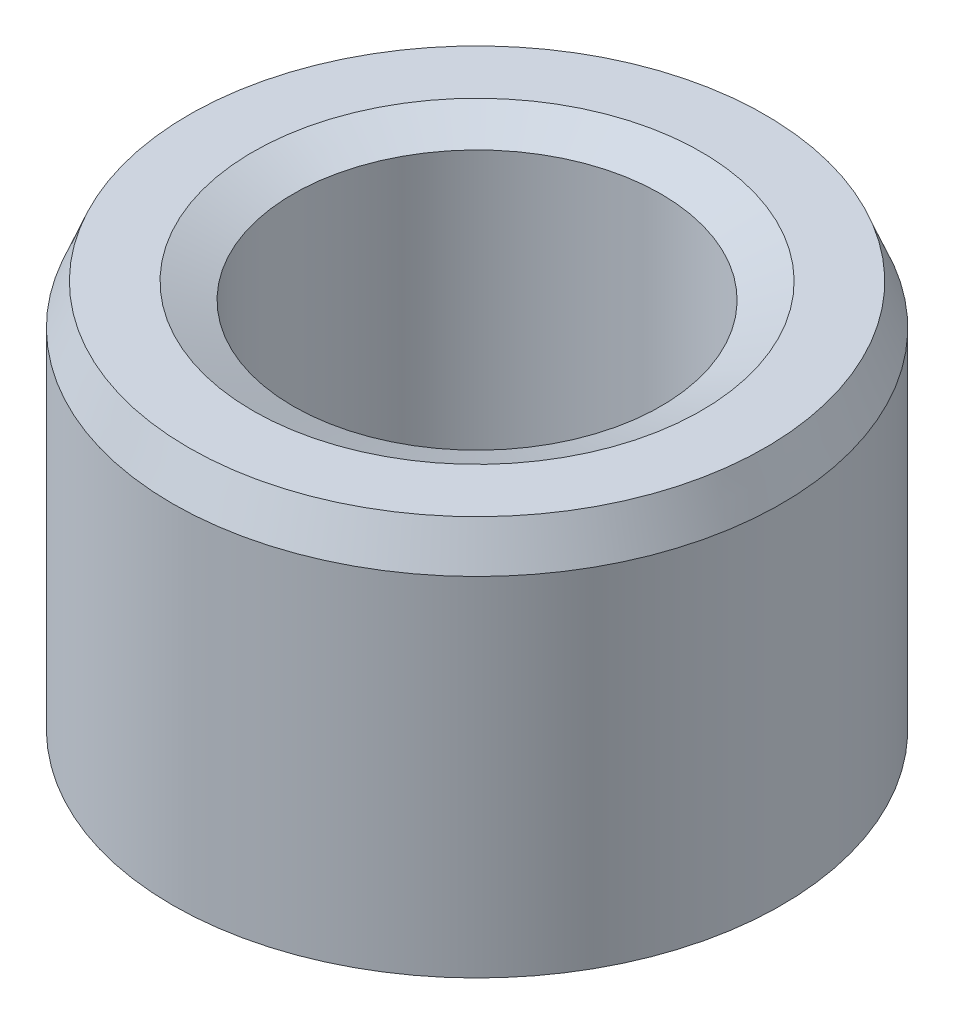
ISO-10303-21;
HEADER;
FILE_DESCRIPTION(('STEP AP214'),'2;1');
FILE_NAME('part.step','',(''),(''),'','','');
FILE_SCHEMA(('AUTOMOTIVE_DESIGN { 1 0 10303 214 1 1 1 1 }'));
ENDSEC;
DATA;
#1=APPLICATION_CONTEXT('core data for automotive mechanical design processes');
#2=APPLICATION_PROTOCOL_DEFINITION('international standard','automotive_design',2000,#1);
#3=PRODUCT_CONTEXT('',#1,'mechanical');
#4=PRODUCT('Part','Part','',(#3));
#5=PRODUCT_RELATED_PRODUCT_CATEGORY('part','',(#4));
#6=PRODUCT_DEFINITION_FORMATION('','',#4);
#7=PRODUCT_DEFINITION_CONTEXT('part definition',#1,'design');
#8=PRODUCT_DEFINITION('design','',#6,#7);
#9=PRODUCT_DEFINITION_SHAPE('','',#8);
#10=(LENGTH_UNIT() NAMED_UNIT(*) SI_UNIT(.MILLI.,.METRE.));
#11=(NAMED_UNIT(*) PLANE_ANGLE_UNIT() SI_UNIT($,.RADIAN.));
#12=(NAMED_UNIT(*) SI_UNIT($,.STERADIAN.) SOLID_ANGLE_UNIT());
#13=UNCERTAINTY_MEASURE_WITH_UNIT(LENGTH_MEASURE(1.E-05),#10,'distance_accuracy_value','');
#14=(GEOMETRIC_REPRESENTATION_CONTEXT(3) GLOBAL_UNCERTAINTY_ASSIGNED_CONTEXT((#13)) GLOBAL_UNIT_ASSIGNED_CONTEXT((#10,
#11,#12)) REPRESENTATION_CONTEXT('',''));
#15=CARTESIAN_POINT('',(0.,0.,0.));
#16=DIRECTION('',(0.,0.,1.));
#17=DIRECTION('',(1.,0.,0.));
#18=AXIS2_PLACEMENT_3D('',#15,#16,#17);
#19=CARTESIAN_POINT('',(0.,26.548351911749,0.));
#20=DIRECTION('',(0.,-1.,0.));
#21=DIRECTION('',(0.,0.,-1.));
#22=AXIS2_PLACEMENT_3D('',#19,#20,#21);
#23=CYLINDRICAL_SURFACE('',#22,20.);
#24=CARTESIAN_POINT('',(0.,1.0674622545707,0.));
#25=DIRECTION('',(0.,1.,0.));
#26=DIRECTION('',(0.,0.,1.));
#27=AXIS2_PLACEMENT_3D('',#24,#25,#26);
#28=CIRCLE('',#27,20.);
#29=CARTESIAN_POINT('',(0.,1.0674622545707,20.));
#30=VERTEX_POINT('',#29);
#31=EDGE_CURVE('E10',#30,#30,#28,.T.);
#32=ORIENTED_EDGE('',*,*,#31,.T.);
#33=EDGE_LOOP('',(#32));
#34=FACE_BOUND('',#33,.T.);
#35=CARTESIAN_POINT('',(0.,23.9010446228975,0.));
#36=DIRECTION('',(0.,1.,0.));
#37=DIRECTION('',(0.,0.,1.));
#38=AXIS2_PLACEMENT_3D('',#35,#36,#37);
#39=CIRCLE('',#38,20.);
#40=CARTESIAN_POINT('',(0.,23.9010446228975,20.));
#41=VERTEX_POINT('',#40);
#42=EDGE_CURVE('E50',#41,#41,#39,.F.);
#43=ORIENTED_EDGE('',*,*,#42,.T.);
#44=EDGE_LOOP('',(#43));
#45=FACE_BOUND('',#44,.T.);
#46=ADVANCED_FACE('F39',(#34,#45),#23,.T.);
#47=CARTESIAN_POINT('',(0.,26.548351911749,0.));
#48=DIRECTION('',(0.,1.,0.));
#49=DIRECTION('',(0.,0.,1.));
#50=AXIS2_PLACEMENT_3D('',#47,#48,#49);
#51=PLANE('',#50);
#52=CARTESIAN_POINT('',(0.,26.548351911749,0.));
#53=DIRECTION('',(0.,1.,0.));
#54=DIRECTION('',(0.,0.,1.));
#55=AXIS2_PLACEMENT_3D('',#52,#53,#54);
#56=CIRCLE('',#55,14.7238597450675);
#57=CARTESIAN_POINT('',(0.,26.548351911749,14.7238597450675));
#58=VERTEX_POINT('',#57);
#59=EDGE_CURVE('E58',#58,#58,#56,.F.);
#60=ORIENTED_EDGE('',*,*,#59,.T.);
#61=EDGE_LOOP('',(#60));
#62=FACE_BOUND('',#61,.T.);
#63=CARTESIAN_POINT('',(0.,26.548351911749,0.));
#64=DIRECTION('',(0.,1.,0.));
#65=DIRECTION('',(0.,0.,1.));
#66=AXIS2_PLACEMENT_3D('',#63,#64,#65);
#67=CIRCLE('',#66,18.9325377454293);
#68=CARTESIAN_POINT('',(0.,26.548351911749,18.9325377454293));
#69=VERTEX_POINT('',#68);
#70=EDGE_CURVE('E61',#69,#69,#67,.T.);
#71=ORIENTED_EDGE('',*,*,#70,.T.);
#72=EDGE_LOOP('',(#71));
#73=FACE_BOUND('',#72,.T.);
#74=ADVANCED_FACE('F88',(#62,#73),#51,.T.);
#75=CARTESIAN_POINT('',(0.,0.,0.));
#76=DIRECTION('',(0.,1.,0.));
#77=DIRECTION('',(0.,0.,1.));
#78=AXIS2_PLACEMENT_3D('',#75,#76,#77);
#79=PLANE('',#78);
#80=CARTESIAN_POINT('',(0.,0.,0.));
#81=DIRECTION('',(0.,1.,0.));
#82=DIRECTION('',(0.,0.,1.));
#83=AXIS2_PLACEMENT_3D('',#80,#81,#82);
#84=CIRCLE('',#83,13.1440147107868);
#85=CARTESIAN_POINT('',(0.,0.,-13.1440147107868));
#86=VERTEX_POINT('',#85);
#87=EDGE_CURVE('E51',#86,#86,#84,.T.);
#88=ORIENTED_EDGE('',*,*,#87,.T.);
#89=EDGE_LOOP('',(#88));
#90=FACE_BOUND('',#89,.T.);
#91=CARTESIAN_POINT('',(0.,0.,0.));
#92=DIRECTION('',(0.,1.,0.));
#93=DIRECTION('',(0.,0.,1.));
#94=AXIS2_PLACEMENT_3D('',#91,#92,#93);
#95=CIRCLE('',#94,17.3526927111486);
#96=CARTESIAN_POINT('',(0.,0.,17.3526927111486));
#97=VERTEX_POINT('',#96);
#98=EDGE_CURVE('E54',#97,#97,#95,.F.);
#99=ORIENTED_EDGE('',*,*,#98,.T.);
#100=EDGE_LOOP('',(#99));
#101=FACE_BOUND('',#100,.T.);
#102=ADVANCED_FACE('F83',(#90,#101),#79,.F.);
#103=CARTESIAN_POINT('',(0.,26.548351911749,0.));
#104=DIRECTION('',(0.,-1.,0.));
#105=DIRECTION('',(0.,0.,-1.));
#106=AXIS2_PLACEMENT_3D('',#103,#104,#105);
#107=CYLINDRICAL_SURFACE('',#106,12.0765524562161);
#108=CARTESIAN_POINT('',(0.,25.4808896571783,0.));
#109=DIRECTION('',(0.,1.,0.));
#110=DIRECTION('',(0.,0.,1.));
#111=AXIS2_PLACEMENT_3D('',#108,#109,#110);
#112=CIRCLE('',#111,12.0765524562161);
#113=CARTESIAN_POINT('',(0.,25.4808896571783,-12.0765524562161));
#114=VERTEX_POINT('',#113);
#115=EDGE_CURVE('E67',#114,#114,#112,.T.);
#116=CARTESIAN_POINT('',(0.,2.64730728885141,0.));
#117=DIRECTION('',(0.,1.,0.));
#118=DIRECTION('',(0.,0.,1.));
#119=AXIS2_PLACEMENT_3D('',#116,#117,#118);
#120=CIRCLE('',#119,12.0765524562161);
#121=CARTESIAN_POINT('',(0.,2.64730728885141,-12.0765524562161));
#122=VERTEX_POINT('',#121);
#123=EDGE_CURVE('E69',#122,#122,#120,.F.);
#124=CARTESIAN_POINT('',(0.,25.4808896571783,-12.0765524562161));
#125=CARTESIAN_POINT('',(0.,25.2430398408416,-12.0765524562161));
#126=CARTESIAN_POINT('',(0.,25.0051900245048,-12.0765524562161));
#127=CARTESIAN_POINT('',(0.,24.5294903918313,-12.0765524562161));
#128=CARTESIAN_POINT('',(0.,24.2916405754946,-12.0765524562161));
#129=CARTESIAN_POINT('',(0.,23.8159409428211,-12.0765524562161));
#130=CARTESIAN_POINT('',(0.,23.5780911264844,-12.0765524562161));
#131=CARTESIAN_POINT('',(0.,23.1023914938109,-12.0765524562161));
#132=CARTESIAN_POINT('',(0.,22.8645416774742,-12.0765524562161));
#133=CARTESIAN_POINT('',(0.,22.3888420448007,-12.0765524562161));
#134=CARTESIAN_POINT('',(0.,22.150992228464,-12.0765524562161));
#135=CARTESIAN_POINT('',(0.,21.6752925957905,-12.0765524562161));
#136=CARTESIAN_POINT('',(0.,21.4374427794537,-12.0765524562161));
#137=CARTESIAN_POINT('',(0.,20.9617431467803,-12.0765524562161));
#138=CARTESIAN_POINT('',(0.,20.7238933304435,-12.0765524562161));
#139=CARTESIAN_POINT('',(0.,20.2481936977701,-12.0765524562161));
#140=CARTESIAN_POINT('',(0.,20.0103438814333,-12.0765524562161));
#141=CARTESIAN_POINT('',(0.,19.5346442487598,-12.0765524562161));
#142=CARTESIAN_POINT('',(0.,19.2967944324231,-12.0765524562161));
#143=CARTESIAN_POINT('',(0.,18.8210947997496,-12.0765524562161));
#144=CARTESIAN_POINT('',(0.,18.5832449834129,-12.0765524562161));
#145=CARTESIAN_POINT('',(0.,18.1075453507394,-12.0765524562161));
#146=CARTESIAN_POINT('',(0.,17.8696955344027,-12.0765524562161));
#147=CARTESIAN_POINT('',(0.,17.3939959017292,-12.0765524562161));
#148=CARTESIAN_POINT('',(0.,17.1561460853925,-12.0765524562161));
#149=CARTESIAN_POINT('',(0.,16.680446452719,-12.0765524562161));
#150=CARTESIAN_POINT('',(0.,16.4425966363822,-12.0765524562161));
#151=CARTESIAN_POINT('',(0.,15.9668970037088,-12.0765524562161));
#152=CARTESIAN_POINT('',(0.,15.729047187372,-12.0765524562161));
#153=CARTESIAN_POINT('',(0.,15.2533475546985,-12.0765524562161));
#154=CARTESIAN_POINT('',(0.,15.0154977383618,-12.0765524562161));
#155=CARTESIAN_POINT('',(0.,14.5397981056883,-12.0765524562161));
#156=CARTESIAN_POINT('',(0.,14.3019482893516,-12.0765524562161));
#157=CARTESIAN_POINT('',(0.,13.8262486566781,-12.0765524562161));
#158=CARTESIAN_POINT('',(0.,13.5883988403414,-12.0765524562161));
#159=CARTESIAN_POINT('',(0.,13.1126992076679,-12.0765524562161));
#160=CARTESIAN_POINT('',(0.,12.8748493913312,-12.0765524562161));
#161=CARTESIAN_POINT('',(0.,12.3991497586577,-12.0765524562161));
#162=CARTESIAN_POINT('',(0.,12.1612999423209,-12.0765524562161));
#163=CARTESIAN_POINT('',(0.,11.6856003096475,-12.0765524562161));
#164=CARTESIAN_POINT('',(0.,11.4477504933107,-12.0765524562161));
#165=CARTESIAN_POINT('',(0.,10.9720508606373,-12.0765524562161));
#166=CARTESIAN_POINT('',(0.,10.7342010443005,-12.0765524562161));
#167=CARTESIAN_POINT('',(0.,10.258501411627,-12.0765524562161));
#168=CARTESIAN_POINT('',(0.,10.0206515952903,-12.0765524562161));
#169=CARTESIAN_POINT('',(0.,9.54495196261682,-12.0765524562161));
#170=CARTESIAN_POINT('',(0.,9.30710214628008,-12.0765524562161));
#171=CARTESIAN_POINT('',(0.,8.8314025136066,-12.0765524562161));
#172=CARTESIAN_POINT('',(0.,8.59355269726987,-12.0765524562161));
#173=CARTESIAN_POINT('',(0.,8.11785306459639,-12.0765524562161));
#174=CARTESIAN_POINT('',(0.,7.88000324825965,-12.0765524562161));
#175=CARTESIAN_POINT('',(0.,7.40430361558618,-12.0765524562161));
#176=CARTESIAN_POINT('',(0.,7.16645379924944,-12.0765524562161));
#177=CARTESIAN_POINT('',(0.,6.69075416657596,-12.0765524562161));
#178=CARTESIAN_POINT('',(0.,6.45290435023922,-12.0765524562161));
#179=CARTESIAN_POINT('',(0.,5.97720471756575,-12.0765524562161));
#180=CARTESIAN_POINT('',(0.,5.73935490122901,-12.0765524562161));
#181=CARTESIAN_POINT('',(0.,5.26365526855553,-12.0765524562161));
#182=CARTESIAN_POINT('',(0.,5.02580545221879,-12.0765524562161));
#183=CARTESIAN_POINT('',(0.,4.55010581954531,-12.0765524562161));
#184=CARTESIAN_POINT('',(0.,4.31225600320858,-12.0765524562161));
#185=CARTESIAN_POINT('',(0.,3.8365563705351,-12.0765524562161));
#186=CARTESIAN_POINT('',(0.,3.59870655419836,-12.0765524562161));
#187=CARTESIAN_POINT('',(0.,3.12300692152488,-12.0765524562161));
#188=CARTESIAN_POINT('',(0.,2.88515710518815,-12.0765524562161));
#189=CARTESIAN_POINT('',(0.,2.64730728885141,-12.0765524562161));
#190=B_SPLINE_CURVE_WITH_KNOTS('',3,(#124,#125,#126,#127,#128,#129,#130,#131,#132,#133,#134,
#135,#136,#137,#138,#139,#140,#141,#142,#143,#144,#145,#146,#147,#148,#149,#150,#151,#152,#153,
#154,#155,#156,#157,#158,#159,#160,#161,#162,#163,#164,#165,#166,#167,#168,#169,#170,#171,#172,
#173,#174,#175,#176,#177,#178,#179,#180,#181,#182,#183,#184,#185,#186,#187,#188,#189),
.UNSPECIFIED.,.F.,.F.,(4,2,2,2,2,2,2,2,2,2,2,2,2,2,2,2,2,2,2,2,2,2,2,2,2,2,2,2,2,2,2,2,4),(0.,
0.713549449010219,1.42709889802043,2.14064834703065,2.85419779604086,3.56774724505108,
4.28129669406129,4.99484614307151,5.70839559208172,6.42194504109194,7.13549449010215,
7.84904393911237,8.56259338812258,9.2761428371328,9.98969228614301,10.7032417351532,
11.4167911841634,12.1303406331737,12.8438900821839,13.5574395311941,14.2709889802043,
14.9845384292145,15.6980878782247,16.411637327235,17.1251867762452,17.8387362252554,
18.5522856742656,19.2658351232758,19.979384572286,20.6929340212962,21.4064834703065,
22.1200329193167,22.8335823683269),.UNSPECIFIED.);
#191=EDGE_CURVE('BSEAM71',#114,#122,#190,.T.);
#192=ORIENTED_EDGE('',*,*,#115,.T.);
#193=ORIENTED_EDGE('',*,*,#123,.T.);
#194=ORIENTED_EDGE('',*,*,#191,.T.);
#195=ORIENTED_EDGE('',*,*,#191,.F.);
#196=EDGE_LOOP('',(#192,#194,#193,#195));
#197=FACE_BOUND('',#196,.T.);
#198=ADVANCED_FACE('F71',(#197),#107,.F.);
#199=CARTESIAN_POINT('',(0.,25.4808896571783,0.));
#200=DIRECTION('',(0.,1.,0.));
#201=DIRECTION('',(0.,0.,1.));
#202=AXIS2_PLACEMENT_3D('',#199,#200,#201);
#203=CONICAL_SURFACE('',#202,12.0765524562161,1.1875122966362);
#204=ORIENTED_EDGE('',*,*,#59,.F.);
#205=EDGE_LOOP('',(#204));
#206=FACE_BOUND('',#205,.T.);
#207=ORIENTED_EDGE('',*,*,#115,.F.);
#208=EDGE_LOOP('',(#207));
#209=FACE_BOUND('',#208,.T.);
#210=ADVANCED_FACE('F77',(#206,#209),#203,.F.);
#211=CARTESIAN_POINT('',(0.,0.,0.));
#212=DIRECTION('',(0.,-1.,0.));
#213=DIRECTION('',(0.,0.,-1.));
#214=AXIS2_PLACEMENT_3D('',#211,#212,#213);
#215=CONICAL_SURFACE('',#214,13.1440147107868,0.383284030158699);
#216=CARTESIAN_POINT('',(0.,2.64730728885141,-12.0765524562161));
#217=CARTESIAN_POINT('',(0.,2.61973117125921,-12.0876718547012));
#218=CARTESIAN_POINT('',(0.,2.59215505366701,-12.0987912531863));
#219=CARTESIAN_POINT('',(0.,2.5370028184826,-12.1210300501565));
#220=CARTESIAN_POINT('',(0.,2.5094267008904,-12.1321494486417));
#221=CARTESIAN_POINT('',(0.,2.45427446570599,-12.1543882456119));
#222=CARTESIAN_POINT('',(0.,2.42669834811379,-12.165507644097));
#223=CARTESIAN_POINT('',(0.,2.37154611292939,-12.1877464410672));
#224=CARTESIAN_POINT('',(0.,2.34396999533719,-12.1988658395523));
#225=CARTESIAN_POINT('',(0.,2.28881776015278,-12.2211046365225));
#226=CARTESIAN_POINT('',(0.,2.26124164256058,-12.2322240350077));
#227=CARTESIAN_POINT('',(0.,2.20608940737617,-12.2544628319779));
#228=CARTESIAN_POINT('',(0.,2.17851328978397,-12.265582230463));
#229=CARTESIAN_POINT('',(0.,2.12336105459957,-12.2878210274332));
#230=CARTESIAN_POINT('',(0.,2.09578493700737,-12.2989404259183));
#231=CARTESIAN_POINT('',(0.,2.04063270182296,-12.3211792228885));
#232=CARTESIAN_POINT('',(0.,2.01305658423076,-12.3322986213737));
#233=CARTESIAN_POINT('',(0.,1.95790434904635,-12.3545374183439));
#234=CARTESIAN_POINT('',(0.,1.93032823145415,-12.365656816829));
#235=CARTESIAN_POINT('',(0.,1.87517599626975,-12.3878956137992));
#236=CARTESIAN_POINT('',(0.,1.84759987867755,-12.3990150122843));
#237=CARTESIAN_POINT('',(0.,1.79244764349314,-12.4212538092546));
#238=CARTESIAN_POINT('',(0.,1.76487152590094,-12.4323732077397));
#239=CARTESIAN_POINT('',(0.,1.70971929071654,-12.4546120047099));
#240=CARTESIAN_POINT('',(0.,1.68214317312433,-12.465731403195));
#241=CARTESIAN_POINT('',(0.,1.62699093793993,-12.4879702001652));
#242=CARTESIAN_POINT('',(0.,1.59941482034773,-12.4990895986503));
#243=CARTESIAN_POINT('',(0.,1.54426258516332,-12.5213283956206));
#244=CARTESIAN_POINT('',(0.,1.51668646757112,-12.5324477941057));
#245=CARTESIAN_POINT('',(0.,1.46153423238672,-12.5546865910759));
#246=CARTESIAN_POINT('',(0.,1.43395811479451,-12.565805989561));
#247=CARTESIAN_POINT('',(0.,1.37880587961011,-12.5880447865312));
#248=CARTESIAN_POINT('',(0.,1.35122976201791,-12.5991641850163));
#249=CARTESIAN_POINT('',(0.,1.2960775268335,-12.6214029819866));
#250=CARTESIAN_POINT('',(0.,1.2685014092413,-12.6325223804717));
#251=CARTESIAN_POINT('',(0.,1.2133491740569,-12.6547611774419));
#252=CARTESIAN_POINT('',(0.,1.18577305646469,-12.665880575927));
#253=CARTESIAN_POINT('',(0.,1.13062082128029,-12.6881193728972));
#254=CARTESIAN_POINT('',(0.,1.10304470368809,-12.6992387713823));
#255=CARTESIAN_POINT('',(0.,1.04789246850368,-12.7214775683526));
#256=CARTESIAN_POINT('',(0.,1.02031635091148,-12.7325969668377));
#257=CARTESIAN_POINT('',(0.,0.965164115727076,-12.7548357638079));
#258=CARTESIAN_POINT('',(0.,0.937587998134874,-12.765955162293));
#259=CARTESIAN_POINT('',(0.,0.88243576295047,-12.7881939592632));
#260=CARTESIAN_POINT('',(0.,0.854859645358268,-12.7993133577483));
#261=CARTESIAN_POINT('',(0.,0.799707410173863,-12.8215521547186));
#262=CARTESIAN_POINT('',(0.,0.772131292581661,-12.8326715532037));
#263=CARTESIAN_POINT('',(0.,0.716979057397257,-12.8549103501739));
#264=CARTESIAN_POINT('',(0.,0.689402939805054,-12.866029748659));
#265=CARTESIAN_POINT('',(0.,0.63425070462065,-12.8882685456292));
#266=CARTESIAN_POINT('',(0.,0.606674587028448,-12.8993879441143));
#267=CARTESIAN_POINT('',(0.,0.551522351844044,-12.9216267410846));
#268=CARTESIAN_POINT('',(0.,0.523946234251841,-12.9327461395697));
#269=CARTESIAN_POINT('',(0.,0.468793999067437,-12.9549849365399));
#270=CARTESIAN_POINT('',(0.,0.441217881475235,-12.966104335025));
#271=CARTESIAN_POINT('',(0.,0.38606564629083,-12.9883431319952));
#272=CARTESIAN_POINT('',(0.,0.358489528698628,-12.9994625304803));
#273=CARTESIAN_POINT('',(0.,0.303337293514224,-13.0217013274506));
#274=CARTESIAN_POINT('',(0.,0.275761175922022,-13.0328207259357));
#275=CARTESIAN_POINT('',(0.,0.220608940737618,-13.0550595229059));
#276=CARTESIAN_POINT('',(0.,0.193032823145415,-13.066178921391));
#277=CARTESIAN_POINT('',(0.,0.137880587961011,-13.0884177183612));
#278=CARTESIAN_POINT('',(0.,0.110304470368809,-13.0995371168463));
#279=CARTESIAN_POINT('',(0.,0.0551522351844044,-13.1217759138166));
#280=CARTESIAN_POINT('',(0.,0.0275761175922024,-13.1328953123017));
#281=CARTESIAN_POINT('',(0.,0.,-13.1440147107868));
#282=B_SPLINE_CURVE_WITH_KNOTS('',3,(#216,#217,#218,#219,#220,#221,#222,#223,#224,#225,#226,
#227,#228,#229,#230,#231,#232,#233,#234,#235,#236,#237,#238,#239,#240,#241,#242,#243,#244,#245,
#246,#247,#248,#249,#250,#251,#252,#253,#254,#255,#256,#257,#258,#259,#260,#261,#262,#263,#264,
#265,#266,#267,#268,#269,#270,#271,#272,#273,#274,#275,#276,#277,#278,#279,#280,#281),
.UNSPECIFIED.,.F.,.F.,(4,2,2,2,2,2,2,2,2,2,2,2,2,2,2,2,2,2,2,2,2,2,2,2,2,2,2,2,2,2,2,2,4),(0.,
0.0892006141075656,0.178401228215132,0.267601842322699,0.356802456430265,0.44600307053783,
0.535203684645397,0.624404298752963,0.713604912860529,0.802805526968095,0.892006141075661,
0.981206755183227,1.07040736929079,1.15960798339836,1.24880859750593,1.33800921161349,
1.42720982572106,1.51641043982862,1.60561105393619,1.69481166804376,1.78401228215132,
1.87321289625889,1.96241351036645,2.05161412447402,2.14081473858159,2.23001535268915,
2.31921596679672,2.40841658090429,2.49761719501185,2.58681780911942,2.67601842322698,
2.76521903733455,2.85441965144212),.UNSPECIFIED.);
#283=EDGE_CURVE('BSEAM73',#122,#86,#282,.T.);
#284=ORIENTED_EDGE('',*,*,#123,.F.);
#285=ORIENTED_EDGE('',*,*,#87,.F.);
#286=ORIENTED_EDGE('',*,*,#283,.T.);
#287=ORIENTED_EDGE('',*,*,#283,.F.);
#288=EDGE_LOOP('',(#284,#286,#285,#287));
#289=FACE_BOUND('',#288,.T.);
#290=ADVANCED_FACE('F73',(#289),#215,.F.);
#291=CARTESIAN_POINT('',(0.,1.0674622545707,0.));
#292=DIRECTION('',(0.,1.,0.));
#293=DIRECTION('',(0.,0.,1.));
#294=AXIS2_PLACEMENT_3D('',#291,#292,#293);
#295=CONICAL_SURFACE('',#294,20.,1.1875122966362);
#296=CARTESIAN_POINT('',(0.,0.,17.3526927111486));
#297=CARTESIAN_POINT('',(0.,0.0111193984851112,17.3802688287408));
#298=CARTESIAN_POINT('',(0.,0.0222387969702226,17.407844946333));
#299=CARTESIAN_POINT('',(0.,0.0444775939404455,17.4629971815174));
#300=CARTESIAN_POINT('',(0.,0.0555969924255569,17.4905732991096));
#301=CARTESIAN_POINT('',(0.,0.0778357893957797,17.545725534294));
#302=CARTESIAN_POINT('',(0.,0.088955187880891,17.5733016518862));
#303=CARTESIAN_POINT('',(0.,0.111193984851114,17.6284538870706));
#304=CARTESIAN_POINT('',(0.,0.122313383336225,17.6560300046628));
#305=CARTESIAN_POINT('',(0.,0.144552180306448,17.7111822398472));
#306=CARTESIAN_POINT('',(0.,0.15567157879156,17.7387583574394));
#307=CARTESIAN_POINT('',(0.,0.177910375761782,17.7939105926238));
#308=CARTESIAN_POINT('',(0.,0.189029774246894,17.821486710216));
#309=CARTESIAN_POINT('',(0.,0.211268571217117,17.8766389454004));
#310=CARTESIAN_POINT('',(0.,0.222387969702228,17.9042150629926));
#311=CARTESIAN_POINT('',(0.,0.244626766672451,17.959367298177));
#312=CARTESIAN_POINT('',(0.,0.255746165157563,17.9869434157692));
#313=CARTESIAN_POINT('',(0.,0.277984962127785,18.0420956509536));
#314=CARTESIAN_POINT('',(0.,0.289104360612896,18.0696717685458));
#315=CARTESIAN_POINT('',(0.,0.311343157583119,18.1248240037302));
#316=CARTESIAN_POINT('',(0.,0.322462556068231,18.1524001213224));
#317=CARTESIAN_POINT('',(0.,0.344701353038454,18.2075523565068));
#318=CARTESIAN_POINT('',(0.,0.355820751523565,18.235128474099));
#319=CARTESIAN_POINT('',(0.,0.378059548493788,18.2902807092834));
#320=CARTESIAN_POINT('',(0.,0.389178946978899,18.3178568268756));
#321=CARTESIAN_POINT('',(0.,0.411417743949122,18.37300906206));
#322=CARTESIAN_POINT('',(0.,0.422537142434234,18.4005851796523));
#323=CARTESIAN_POINT('',(0.,0.444775939404456,18.4557374148367));
#324=CARTESIAN_POINT('',(0.,0.455895337889568,18.4833135324289));
#325=CARTESIAN_POINT('',(0.,0.478134134859791,18.5384657676133));
#326=CARTESIAN_POINT('',(0.,0.489253533344902,18.5660418852055));
#327=CARTESIAN_POINT('',(0.,0.511492330315125,18.6211941203899));
#328=CARTESIAN_POINT('',(0.,0.522611728800236,18.6487702379821));
#329=CARTESIAN_POINT('',(0.,0.544850525770459,18.7039224731665));
#330=CARTESIAN_POINT('',(0.,0.555969924255571,18.7314985907587));
#331=CARTESIAN_POINT('',(0.,0.578208721225794,18.7866508259431));
#332=CARTESIAN_POINT('',(0.,0.589328119710905,18.8142269435353));
#333=CARTESIAN_POINT('',(0.,0.611566916681128,18.8693791787197));
#334=CARTESIAN_POINT('',(0.,0.622686315166239,18.8969552963119));
#335=CARTESIAN_POINT('',(0.,0.644925112136462,18.9521075314963));
#336=CARTESIAN_POINT('',(0.,0.656044510621573,18.9796836490885));
#337=CARTESIAN_POINT('',(0.,0.678283307591796,19.0348358842729));
#338=CARTESIAN_POINT('',(0.,0.689402706076908,19.0624120018651));
#339=CARTESIAN_POINT('',(0.,0.71164150304713,19.1175642370495));
#340=CARTESIAN_POINT('',(0.,0.722760901532242,19.1451403546417));
#341=CARTESIAN_POINT('',(0.,0.744999698502465,19.2002925898261));
#342=CARTESIAN_POINT('',(0.,0.756119096987576,19.2278687074183));
#343=CARTESIAN_POINT('',(0.,0.778357893957799,19.2830209426027));
#344=CARTESIAN_POINT('',(0.,0.78947729244291,19.3105970601949));
#345=CARTESIAN_POINT('',(0.,0.811716089413133,19.3657492953793));
#346=CARTESIAN_POINT('',(0.,0.822835487898245,19.3933254129715));
#347=CARTESIAN_POINT('',(0.,0.845074284868467,19.4484776481559));
#348=CARTESIAN_POINT('',(0.,0.856193683353579,19.4760537657482));
#349=CARTESIAN_POINT('',(0.,0.878432480323802,19.5312060009326));
#350=CARTESIAN_POINT('',(0.,0.889551878808913,19.5587821185248));
#351=CARTESIAN_POINT('',(0.,0.911790675779136,19.6139343537092));
#352=CARTESIAN_POINT('',(0.,0.922910074264248,19.6415104713014));
#353=CARTESIAN_POINT('',(0.,0.94514887123447,19.6966627064858));
#354=CARTESIAN_POINT('',(0.,0.956268269719582,19.724238824078));
#355=CARTESIAN_POINT('',(0.,0.978507066689804,19.7793910592624));
#356=CARTESIAN_POINT('',(0.,0.989626465174916,19.8069671768546));
#357=CARTESIAN_POINT('',(0.,1.01186526214514,19.862119412039));
#358=CARTESIAN_POINT('',(0.,1.02298466063025,19.8896955296312));
#359=CARTESIAN_POINT('',(0.,1.04522345760047,19.9448477648156));
#360=CARTESIAN_POINT('',(0.,1.05634285608558,19.9724238824078));
#361=CARTESIAN_POINT('',(0.,1.0674622545707,20.));
#362=B_SPLINE_CURVE_WITH_KNOTS('',3,(#296,#297,#298,#299,#300,#301,#302,#303,#304,#305,#306,
#307,#308,#309,#310,#311,#312,#313,#314,#315,#316,#317,#318,#319,#320,#321,#322,#323,#324,#325,
#326,#327,#328,#329,#330,#331,#332,#333,#334,#335,#336,#337,#338,#339,#340,#341,#342,#343,#344,
#345,#346,#347,#348,#349,#350,#351,#352,#353,#354,#355,#356,#357,#358,#359,#360,#361),
.UNSPECIFIED.,.F.,.F.,(4,2,2,2,2,2,2,2,2,2,2,2,2,2,2,2,2,2,2,2,2,2,2,2,2,2,2,2,2,2,2,2,4),(0.,
0.0892006141075669,0.178401228215134,0.267601842322701,0.356802456430267,0.446003070537834,
0.535203684645401,0.624404298752968,0.713604912860535,0.802805526968105,0.892006141075672,
0.981206755183239,1.07040736929081,1.15960798339837,1.24880859750594,1.33800921161351,
1.42720982572107,1.51641043982864,1.60561105393621,1.69481166804378,1.78401228215134,
1.87321289625891,1.96241351036648,2.05161412447404,2.14081473858161,2.23001535268918,
2.31921596679674,2.40841658090431,2.49761719501188,2.58681780911945,2.67601842322701,
2.76521903733458,2.85441965144215),.UNSPECIFIED.);
#363=EDGE_CURVE('BSEAM76',#97,#30,#362,.T.);
#364=ORIENTED_EDGE('',*,*,#98,.F.);
#365=ORIENTED_EDGE('',*,*,#31,.F.);
#366=ORIENTED_EDGE('',*,*,#363,.T.);
#367=ORIENTED_EDGE('',*,*,#363,.F.);
#368=EDGE_LOOP('',(#364,#366,#365,#367));
#369=FACE_BOUND('',#368,.T.);
#370=ADVANCED_FACE('F76',(#369),#295,.T.);
#371=CARTESIAN_POINT('',(0.,26.548351911749,0.));
#372=DIRECTION('',(0.,-1.,0.));
#373=DIRECTION('',(0.,0.,-1.));
#374=AXIS2_PLACEMENT_3D('',#371,#372,#373);
#375=CONICAL_SURFACE('',#374,18.9325377454293,0.383284030158699);
#376=ORIENTED_EDGE('',*,*,#42,.F.);
#377=EDGE_LOOP('',(#376));
#378=FACE_BOUND('',#377,.T.);
#379=ORIENTED_EDGE('',*,*,#70,.F.);
#380=EDGE_LOOP('',(#379));
#381=FACE_BOUND('',#380,.T.);
#382=ADVANCED_FACE('F45',(#378,#381),#375,.T.);
#383=CLOSED_SHELL('',(#46,#74,#102,#198,#210,#290,#370,#382));
#384=MANIFOLD_SOLID_BREP('B2',#383);
#385=ADVANCED_BREP_SHAPE_REPRESENTATION('',(#18,#384),#14);
#386=SHAPE_DEFINITION_REPRESENTATION(#9,#385);
ENDSEC;
END-ISO-10303-21;
